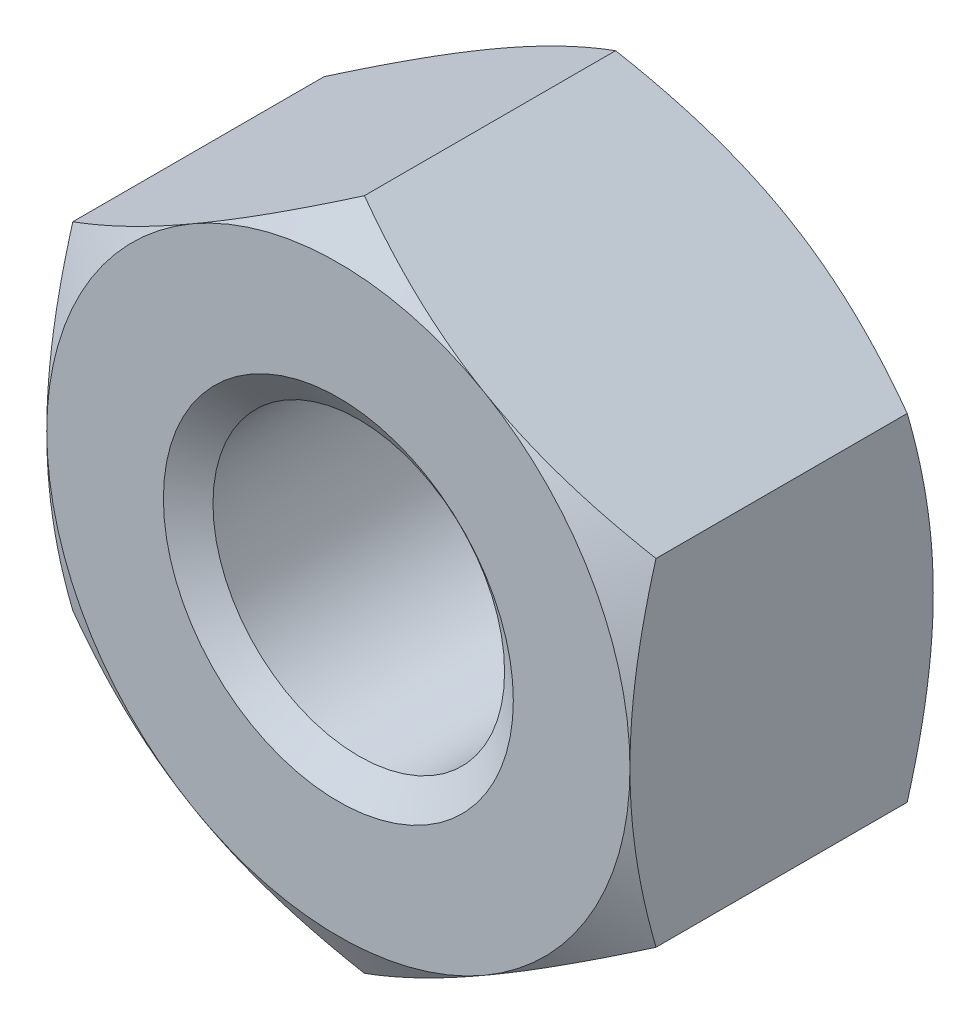
ISO-10303-21;
HEADER;
FILE_DESCRIPTION(('STEP AP214'),'2;1');
FILE_NAME('part.step','',(''),(''),'','','');
FILE_SCHEMA(('AUTOMOTIVE_DESIGN { 1 0 10303 214 1 1 1 1 }'));
ENDSEC;
DATA;
#1=APPLICATION_CONTEXT('core data for automotive mechanical design processes');
#2=APPLICATION_PROTOCOL_DEFINITION('international standard','automotive_design',2000,#1);
#3=PRODUCT_CONTEXT('',#1,'mechanical');
#4=PRODUCT('Part','Part','',(#3));
#5=PRODUCT_RELATED_PRODUCT_CATEGORY('part','',(#4));
#6=PRODUCT_DEFINITION_FORMATION('','',#4);
#7=PRODUCT_DEFINITION_CONTEXT('part definition',#1,'design');
#8=PRODUCT_DEFINITION('design','',#6,#7);
#9=PRODUCT_DEFINITION_SHAPE('','',#8);
#10=(LENGTH_UNIT() NAMED_UNIT(*) SI_UNIT(.MILLI.,.METRE.));
#11=(NAMED_UNIT(*) PLANE_ANGLE_UNIT() SI_UNIT($,.RADIAN.));
#12=(NAMED_UNIT(*) SI_UNIT($,.STERADIAN.) SOLID_ANGLE_UNIT());
#13=UNCERTAINTY_MEASURE_WITH_UNIT(LENGTH_MEASURE(1.E-05),#10,'distance_accuracy_value','');
#14=(GEOMETRIC_REPRESENTATION_CONTEXT(3) GLOBAL_UNCERTAINTY_ASSIGNED_CONTEXT((#13)) GLOBAL_UNIT_ASSIGNED_CONTEXT((#10,
#11,#12)) REPRESENTATION_CONTEXT('',''));
#15=CARTESIAN_POINT('',(0.,0.,0.));
#16=DIRECTION('',(0.,0.,1.));
#17=DIRECTION('',(1.,0.,0.));
#18=AXIS2_PLACEMENT_3D('',#15,#16,#17);
#19=CARTESIAN_POINT('',(0.,0.,-5.2));
#20=DIRECTION('',(0.,0.,1.));
#21=DIRECTION('',(1.,0.,0.));
#22=AXIS2_PLACEMENT_3D('',#19,#20,#21);
#23=CYLINDRICAL_SURFACE('',#22,2.5);
#24=CARTESIAN_POINT('',(0.,0.,-0.350103769104856));
#25=DIRECTION('',(0.,0.,1.));
#26=DIRECTION('',(1.,0.,0.));
#27=AXIS2_PLACEMENT_3D('',#24,#25,#26);
#28=CIRCLE('',#27,2.5);
#29=CARTESIAN_POINT('',(2.5,0.,-0.350103769104856));
#30=VERTEX_POINT('',#29);
#31=EDGE_CURVE('E174',#30,#30,#28,.F.);
#32=ORIENTED_EDGE('',*,*,#31,.F.);
#33=EDGE_LOOP('',(#32));
#34=FACE_BOUND('',#33,.T.);
#35=CARTESIAN_POINT('',(0.,0.,-4.82449623089515));
#36=DIRECTION('',(0.,0.,-1.));
#37=DIRECTION('',(-1.,0.,0.));
#38=AXIS2_PLACEMENT_3D('',#35,#36,#37);
#39=CIRCLE('',#38,2.5);
#40=CARTESIAN_POINT('',(-2.5,0.,-4.82449623089515));
#41=VERTEX_POINT('',#40);
#42=EDGE_CURVE('E39',#41,#41,#39,.F.);
#43=ORIENTED_EDGE('',*,*,#42,.F.);
#44=EDGE_LOOP('',(#43));
#45=FACE_BOUND('',#44,.T.);
#46=ADVANCED_FACE('F34',(#34,#45),#23,.F.);
#47=CARTESIAN_POINT('',(0.,5.77350269189626,-5.2));
#48=DIRECTION('',(-0.500000000000001,0.866025403784438,0.));
#49=DIRECTION('',(-0.866025403784438,-0.500000000000001,0.));
#50=AXIS2_PLACEMENT_3D('',#47,#48,#49);
#51=PLANE('',#50);
#52=DIRECTION('',(0.,0.,1.));
#53=VECTOR('',#52,1.);
#54=CARTESIAN_POINT('',(-5.,2.88675134594813,-5.2));
#55=LINE('',#54,#53);
#56=CARTESIAN_POINT('',(-5.,2.88675134594813,-4.75341801261479));
#57=VERTEX_POINT('',#56);
#58=CARTESIAN_POINT('',(-5.,2.88675134594813,-0.446581987385205));
#59=VERTEX_POINT('',#58);
#60=EDGE_CURVE('E164',#57,#59,#55,.T.);
#61=ORIENTED_EDGE('',*,*,#60,.T.);
#62=CARTESIAN_POINT('',(-5.0002,2.88663587589429,-0.446648656051831));
#63=CARTESIAN_POINT('',(-4.78046540547481,3.01349970319368,-0.373386567637637));
#64=CARTESIAN_POINT('',(-4.55885141554042,3.14144859993849,-0.306751321918093));
#65=CARTESIAN_POINT('',(-4.11178600454649,3.39956193532121,-0.190438991010811));
#66=CARTESIAN_POINT('',(-3.88632664040923,3.52973095989718,-0.140803049915789));
#67=CARTESIAN_POINT('',(-3.43816769477649,3.78847564779798,-0.0635510254186975));
#68=CARTESIAN_POINT('',(-3.2155379068958,3.91701101576052,-0.0354203782834889));
#69=CARTESIAN_POINT('',(-2.88081009815336,4.11026620624323,-0.010194921953684));
#70=CARTESIAN_POINT('',(-2.76915780319494,4.17472868879311,-0.00461345976948343));
#71=CARTESIAN_POINT('',(-2.5457500293262,4.30371322717528,0.000797783248530056));
#72=CARTESIAN_POINT('',(-2.43399455370968,4.36823528110589,0.000627741741796608));
#73=CARTESIAN_POINT('',(-2.12781576914936,4.54500768479195,-0.00775363179203721));
#74=CARTESIAN_POINT('',(-1.93349391403278,4.65719946015293,-0.0218297718972525));
#75=CARTESIAN_POINT('',(-1.54613989800229,4.88083840557981,-0.0664652571094324));
#76=CARTESIAN_POINT('',(-1.35310909862843,4.9922847895602,-0.0970398601475099));
#77=CARTESIAN_POINT('',(-0.964974657525145,5.21637431361295,-0.173468493621166));
#78=CARTESIAN_POINT('',(-0.769920001358263,5.32898917185759,-0.219646378878683));
#79=CARTESIAN_POINT('',(-0.382719654641231,5.55253939626499,-0.324451794491938));
#80=CARTESIAN_POINT('',(-0.190569004591913,5.66347762579592,-0.383054703437379));
#81=CARTESIAN_POINT('',(0.000200000000000074,5.7736181619501,-0.446648656051834));
#82=B_SPLINE_CURVE_WITH_KNOTS('',3,(#62,#63,#64,#65,#66,#67,#68,#69,#70,#71,#72,#73,#74,#75,#76,
#77,#78,#79,#80,#81),.UNSPECIFIED.,.F.,.F.,(4,2,2,2,2,2,2,2,2,4),(0.,0.792555841363091,
1.58701660053334,2.36181537487281,2.74884076077326,3.13585419177295,3.8096236259968,
4.4840172390119,5.17336882348929,5.86136694793726),.UNSPECIFIED.);
#83=CARTESIAN_POINT('',(-2.5,4.33012701892219,0.));
#84=VERTEX_POINT('',#83);
#85=EDGE_CURVE('E133',#59,#84,#82,.T.);
#86=ORIENTED_EDGE('',*,*,#85,.T.);
#87=CARTESIAN_POINT('',(0.,5.77350269189626,-0.446581987385207));
#88=VERTEX_POINT('',#87);
#89=EDGE_CURVE('E53',#84,#88,#82,.T.);
#90=ORIENTED_EDGE('',*,*,#89,.T.);
#91=DIRECTION('',(0.,0.,1.));
#92=VECTOR('',#91,1.);
#93=CARTESIAN_POINT('',(0.,5.77350269189626,-5.2));
#94=LINE('',#93,#92);
#95=CARTESIAN_POINT('',(0.,5.77350269189626,-4.75341801261479));
#96=VERTEX_POINT('',#95);
#97=EDGE_CURVE('E149',#96,#88,#94,.T.);
#98=ORIENTED_EDGE('',*,*,#97,.F.);
#99=CARTESIAN_POINT('',(-5.0002,2.88663587589429,-4.75335134394817));
#100=CARTESIAN_POINT('',(-4.78046540547482,3.01349970319368,-4.82661343236236));
#101=CARTESIAN_POINT('',(-4.55885141554042,3.14144859993849,-4.89324867808191));
#102=CARTESIAN_POINT('',(-4.11178600454649,3.39956193532121,-5.00956100898919));
#103=CARTESIAN_POINT('',(-3.88632664040922,3.52973095989718,-5.05919695008421));
#104=CARTESIAN_POINT('',(-3.43816769477649,3.78847564779798,-5.1364489745813));
#105=CARTESIAN_POINT('',(-3.2155379068958,3.91701101576052,-5.16457962171651));
#106=CARTESIAN_POINT('',(-2.88081009815336,4.11026620624323,-5.18980507804632));
#107=CARTESIAN_POINT('',(-2.76915780319494,4.17472868879311,-5.19538654023052));
#108=CARTESIAN_POINT('',(-2.5457500293262,4.30371322717528,-5.20079778324853));
#109=CARTESIAN_POINT('',(-2.43399455370968,4.36823528110589,-5.2006277417418));
#110=CARTESIAN_POINT('',(-2.12781576914936,4.54500768479195,-5.19224636820796));
#111=CARTESIAN_POINT('',(-1.93349391403278,4.65719946015293,-5.17817022810275));
#112=CARTESIAN_POINT('',(-1.54613989800229,4.88083840557981,-5.13353474289057));
#113=CARTESIAN_POINT('',(-1.35310909862843,4.9922847895602,-5.10296013985249));
#114=CARTESIAN_POINT('',(-0.964974657525144,5.21637431361295,-5.02653150637883));
#115=CARTESIAN_POINT('',(-0.769920001358264,5.32898917185759,-4.98035362112132));
#116=CARTESIAN_POINT('',(-0.382719654641232,5.55253939626499,-4.87554820550806));
#117=CARTESIAN_POINT('',(-0.190569004591913,5.66347762579592,-4.81694529656262));
#118=CARTESIAN_POINT('',(0.000200000000000076,5.7736181619501,-4.75335134394817));
#119=B_SPLINE_CURVE_WITH_KNOTS('',3,(#99,#100,#101,#102,#103,#104,#105,#106,#107,#108,#109,#110,
#111,#112,#113,#114,#115,#116,#117,#118),.UNSPECIFIED.,.F.,.F.,(4,2,2,2,2,2,2,2,2,4),(0.,
0.792555841363092,1.58701660053334,2.36181537487281,2.74884076077326,3.13585419177295,
3.8096236259968,4.4840172390119,5.17336882348929,5.86136694793726),.UNSPECIFIED.);
#120=CARTESIAN_POINT('',(-2.5,4.33012701892219,-5.2));
#121=VERTEX_POINT('',#120);
#122=EDGE_CURVE('E167',#121,#96,#119,.T.);
#123=ORIENTED_EDGE('',*,*,#122,.F.);
#124=EDGE_CURVE('E266',#57,#121,#119,.T.);
#125=ORIENTED_EDGE('',*,*,#124,.F.);
#126=EDGE_LOOP('',(#61,#86,#90,#98,#123,#125));
#127=FACE_BOUND('',#126,.T.);
#128=ADVANCED_FACE('F36',(#127),#51,.T.);
#129=CARTESIAN_POINT('',(5.,2.88675134594813,-5.2));
#130=DIRECTION('',(0.5,0.866025403784438,0.));
#131=DIRECTION('',(-0.866025403784438,0.5,0.));
#132=AXIS2_PLACEMENT_3D('',#129,#130,#131);
#133=PLANE('',#132);
#134=ORIENTED_EDGE('',*,*,#97,.T.);
#135=CARTESIAN_POINT('',(-0.000200000000000693,5.7736181619501,-0.446648656051833));
#136=CARTESIAN_POINT('',(0.219534594525184,5.64675433465071,-0.373386567637639));
#137=CARTESIAN_POINT('',(0.44114858445958,5.5188054379059,-0.306751321918095));
#138=CARTESIAN_POINT('',(0.888213995453514,5.26069210252318,-0.190438991010812));
#139=CARTESIAN_POINT('',(1.11367335959077,5.13052307794721,-0.14080304991579));
#140=CARTESIAN_POINT('',(1.56183230522351,4.87177839004641,-0.0635510254186981));
#141=CARTESIAN_POINT('',(1.78446209310419,4.74324302208387,-0.0354203782834897));
#142=CARTESIAN_POINT('',(2.11918990184664,4.54998783160116,-0.0101949219536844));
#143=CARTESIAN_POINT('',(2.23084219680506,4.48552534905128,-0.00461345976948354));
#144=CARTESIAN_POINT('',(2.4542499706738,4.35654081066911,0.000797783248530181));
#145=CARTESIAN_POINT('',(2.56600544629032,4.2920187567385,0.000627741741796696));
#146=CARTESIAN_POINT('',(2.87218423085064,4.11524635305244,-0.007753631792037));
#147=CARTESIAN_POINT('',(3.06650608596722,4.00305457769146,-0.0218297718972519));
#148=CARTESIAN_POINT('',(3.45386010199771,3.77941563226457,-0.0664652571094314));
#149=CARTESIAN_POINT('',(3.64689090137157,3.66796924828418,-0.0970398601475088));
#150=CARTESIAN_POINT('',(4.03502534247486,3.44387972423144,-0.173468493621165));
#151=CARTESIAN_POINT('',(4.23007999864174,3.3312648659868,-0.219646378878682));
#152=CARTESIAN_POINT('',(4.61728034535877,3.1077146415794,-0.324451794491937));
#153=CARTESIAN_POINT('',(4.80943099540809,2.99677641204847,-0.383054703437377));
#154=CARTESIAN_POINT('',(5.0002,2.88663587589429,-0.446648656051832));
#155=B_SPLINE_CURVE_WITH_KNOTS('',3,(#135,#136,#137,#138,#139,#140,#141,#142,#143,#144,#145,
#146,#147,#148,#149,#150,#151,#152,#153,#154),.UNSPECIFIED.,.F.,.F.,(4,2,2,2,2,2,2,2,2,4),(0.,
0.792555841363093,1.58701660053334,2.36181537487281,2.74884076077326,3.13585419177295,
3.8096236259968,4.4840172390119,5.17336882348929,5.86136694793726),.UNSPECIFIED.);
#156=CARTESIAN_POINT('',(2.5,4.33012701892219,0.));
#157=VERTEX_POINT('',#156);
#158=EDGE_CURVE('E143',#88,#157,#155,.T.);
#159=ORIENTED_EDGE('',*,*,#158,.T.);
#160=CARTESIAN_POINT('',(5.,2.88675134594813,-0.446581987385207));
#161=VERTEX_POINT('',#160);
#162=EDGE_CURVE('E60',#157,#161,#155,.T.);
#163=ORIENTED_EDGE('',*,*,#162,.T.);
#164=DIRECTION('',(0.,0.,1.));
#165=VECTOR('',#164,1.);
#166=CARTESIAN_POINT('',(5.,2.88675134594813,-5.2));
#167=LINE('',#166,#165);
#168=CARTESIAN_POINT('',(5.,2.88675134594813,-4.75341801261479));
#169=VERTEX_POINT('',#168);
#170=EDGE_CURVE('E142',#169,#161,#167,.T.);
#171=ORIENTED_EDGE('',*,*,#170,.F.);
#172=CARTESIAN_POINT('',(-0.000200000000000693,5.7736181619501,-4.75335134394817));
#173=CARTESIAN_POINT('',(0.219534594525184,5.64675433465071,-4.82661343236236));
#174=CARTESIAN_POINT('',(0.44114858445958,5.5188054379059,-4.89324867808191));
#175=CARTESIAN_POINT('',(0.888213995453514,5.26069210252318,-5.00956100898919));
#176=CARTESIAN_POINT('',(1.11367335959078,5.13052307794721,-5.05919695008421));
#177=CARTESIAN_POINT('',(1.56183230522351,4.87177839004641,-5.1364489745813));
#178=CARTESIAN_POINT('',(1.7844620931042,4.74324302208387,-5.16457962171651));
#179=CARTESIAN_POINT('',(2.11918990184665,4.54998783160116,-5.18980507804632));
#180=CARTESIAN_POINT('',(2.23084219680506,4.48552534905128,-5.19538654023052));
#181=CARTESIAN_POINT('',(2.4542499706738,4.35654081066911,-5.20079778324853));
#182=CARTESIAN_POINT('',(2.56600544629032,4.2920187567385,-5.2006277417418));
#183=CARTESIAN_POINT('',(2.87218423085064,4.11524635305244,-5.19224636820796));
#184=CARTESIAN_POINT('',(3.06650608596722,4.00305457769146,-5.17817022810275));
#185=CARTESIAN_POINT('',(3.45386010199771,3.77941563226457,-5.13353474289057));
#186=CARTESIAN_POINT('',(3.64689090137157,3.66796924828418,-5.10296013985249));
#187=CARTESIAN_POINT('',(4.03502534247485,3.44387972423144,-5.02653150637883));
#188=CARTESIAN_POINT('',(4.23007999864174,3.3312648659868,-4.98035362112132));
#189=CARTESIAN_POINT('',(4.61728034535877,3.1077146415794,-4.87554820550806));
#190=CARTESIAN_POINT('',(4.80943099540809,2.99677641204847,-4.81694529656262));
#191=CARTESIAN_POINT('',(5.0002,2.88663587589429,-4.75335134394817));
#192=B_SPLINE_CURVE_WITH_KNOTS('',3,(#172,#173,#174,#175,#176,#177,#178,#179,#180,#181,#182,
#183,#184,#185,#186,#187,#188,#189,#190,#191),.UNSPECIFIED.,.F.,.F.,(4,2,2,2,2,2,2,2,2,4),(0.,
0.792555841363093,1.58701660053334,2.36181537487281,2.74884076077326,3.13585419177296,
3.8096236259968,4.4840172390119,5.17336882348929,5.86136694793725),.UNSPECIFIED.);
#193=CARTESIAN_POINT('',(2.5,4.33012701892219,-5.2));
#194=VERTEX_POINT('',#193);
#195=EDGE_CURVE('E259',#194,#169,#192,.T.);
#196=ORIENTED_EDGE('',*,*,#195,.F.);
#197=EDGE_CURVE('E265',#96,#194,#192,.T.);
#198=ORIENTED_EDGE('',*,*,#197,.F.);
#199=EDGE_LOOP('',(#134,#159,#163,#171,#196,#198));
#200=FACE_BOUND('',#199,.T.);
#201=ADVANCED_FACE('F140',(#200),#133,.T.);
#202=CARTESIAN_POINT('',(5.,2.88675134594813,-5.2));
#203=DIRECTION('',(-1.,0.,0.));
#204=DIRECTION('',(0.,0.,1.));
#205=AXIS2_PLACEMENT_3D('',#202,#203,#204);
#206=PLANE('',#205);
#207=CARTESIAN_POINT('',(5.,-7.65608998744865,-2.3926335265508));
#208=CARTESIAN_POINT('',(5.,-7.43656171400166,-2.28654533817208));
#209=CARTESIAN_POINT('',(5.,-7.21651440170022,-2.18151175461596));
#210=CARTESIAN_POINT('',(5.,-6.77510105921518,-1.97415643363977));
#211=CARTESIAN_POINT('',(5.,-6.55373480873053,-1.87183516574569));
#212=CARTESIAN_POINT('',(5.,-6.10820714710357,-1.66996807853491));
#213=CARTESIAN_POINT('',(5.,-5.88403698971124,-1.57044149281731));
#214=CARTESIAN_POINT('',(5.,-5.43385418074677,-1.37566323278682));
#215=CARTESIAN_POINT('',(5.,-5.20784162594278,-1.28041133564243));
#216=CARTESIAN_POINT('',(5.,-4.75080884782756,-1.09418830918942));
#217=CARTESIAN_POINT('',(5.,-4.51976121099505,-1.0032840909987));
#218=CARTESIAN_POINT('',(5.,-4.054940534221,-0.828595302971951));
#219=CARTESIAN_POINT('',(5.,-3.82116719434025,-0.744811525247654));
#220=CARTESIAN_POINT('',(5.,-3.35100416711889,-0.58661463236462));
#221=CARTESIAN_POINT('',(5.,-3.11462125088188,-0.512181595225272));
#222=CARTESIAN_POINT('',(5.,-2.63849247870023,-0.375104393872378));
#223=CARTESIAN_POINT('',(5.,-2.3987477121033,-0.31245650159695));
#224=CARTESIAN_POINT('',(5.,-1.91574303714497,-0.201987753994869));
#225=CARTESIAN_POINT('',(5.,-1.672482210841,-0.154170846558642));
#226=CARTESIAN_POINT('',(5.,-1.18299359688664,-0.0765955557924023));
#227=CARTESIAN_POINT('',(5.,-0.93676580661328,-0.0468371884284091));
#228=CARTESIAN_POINT('',(5.,-0.567032279323846,-0.0176512015862963));
#229=CARTESIAN_POINT('',(5.,-0.444105297658538,-0.0104963190599468));
#230=CARTESIAN_POINT('',(5.,-0.198053005238563,-0.00139545226904065));
#231=CARTESIAN_POINT('',(5.,-0.0749276970802267,0.00055059963961463));
#232=CARTESIAN_POINT('',(5.,0.171257999892355,-0.000818470345664016));
#233=CARTESIAN_POINT('',(5.,0.29431839722709,-0.00413211431301166));
#234=CARTESIAN_POINT('',(5.,0.540192730788843,-0.0159365972827601));
#235=CARTESIAN_POINT('',(5.,0.663006654263486,-0.0244276975701651));
#236=CARTESIAN_POINT('',(5.,0.960681872881669,-0.051106380275301));
#237=CARTESIAN_POINT('',(5.,1.1353143627994,-0.0718889676982865));
#238=CARTESIAN_POINT('',(5.,1.48321675799389,-0.122765655722696));
#239=CARTESIAN_POINT('',(5.,1.65648647841236,-0.152860997990035));
#240=CARTESIAN_POINT('',(5.,2.00155426058699,-0.221298792011552));
#241=CARTESIAN_POINT('',(5.,2.17335067370373,-0.259649477486406));
#242=CARTESIAN_POINT('',(5.,2.51518168221054,-0.343428305385012));
#243=CARTESIAN_POINT('',(5.,2.68521638419311,-0.388856016914003));
#244=CARTESIAN_POINT('',(5.,3.02770318928892,-0.486887782054293));
#245=CARTESIAN_POINT('',(5.,3.20011248435312,-0.539640363823943));
#246=CARTESIAN_POINT('',(5.,3.54310870430177,-0.650357787302627));
#247=CARTESIAN_POINT('',(5.,3.71369679659714,-0.708319033907071));
#248=CARTESIAN_POINT('',(5.,4.05236610267974,-0.828256540728475));
#249=CARTESIAN_POINT('',(5.,4.22045602230056,-0.890208365426366));
#250=CARTESIAN_POINT('',(5.,4.55533171687448,-1.01774823413812));
#251=CARTESIAN_POINT('',(5.,4.72211693321414,-1.08333774778777));
#252=CARTESIAN_POINT('',(5.,4.88829623733355,-1.15038625817724));
#253=B_SPLINE_CURVE_WITH_KNOTS('',3,(#207,#208,#209,#210,#211,#212,#213,#214,#215,#216,#217,
#218,#219,#220,#221,#222,#223,#224,#225,#226,#227,#228,#229,#230,#231,#232,#233,#234,#235,#236,
#237,#238,#239,#240,#241,#242,#243,#244,#245,#246,#247,#248,#249,#250,#251,#252),.UNSPECIFIED.,
.F.,.F.,(4,2,2,2,2,2,2,2,2,2,2,2,2,2,2,2,2,2,2,2,2,2,4),(0.,0.731464740665352,1.46305528824909,
2.19883243307486,2.93457117856034,3.67934251246858,4.42419659013361,5.1674358087199,
5.91043951739339,6.65364083834806,7.39684281638516,7.76615414335457,8.13546067426611,
8.50466345177856,8.87388486298453,9.40118542949727,9.92855633110015,10.4564556797854,
10.9843228991235,11.525120280828,12.065547221064,12.6029322754131,13.1405360390026),.UNSPECIFIED.);
#254=CARTESIAN_POINT('',(5.,-2.88675134594813,-0.446581987385207));
#255=VERTEX_POINT('',#254);
#256=CARTESIAN_POINT('',(5.,0.,0.));
#257=VERTEX_POINT('',#256);
#258=EDGE_CURVE('E135',#255,#257,#253,.T.);
#259=ORIENTED_EDGE('',*,*,#258,.F.);
#260=DIRECTION('',(0.,0.,1.));
#261=VECTOR('',#260,1.);
#262=CARTESIAN_POINT('',(5.,-2.88675134594813,-5.2));
#263=LINE('',#262,#261);
#264=CARTESIAN_POINT('',(5.,-2.88675134594813,-4.75341801261479));
#265=VERTEX_POINT('',#264);
#266=EDGE_CURVE('E150',#265,#255,#263,.T.);
#267=ORIENTED_EDGE('',*,*,#266,.F.);
#268=CARTESIAN_POINT('',(5.,-7.65608998744865,-2.8073664734492));
#269=CARTESIAN_POINT('',(5.,-7.43656171400166,-2.91345466182793));
#270=CARTESIAN_POINT('',(5.,-7.21651440170021,-3.01848824538404));
#271=CARTESIAN_POINT('',(5.,-6.77510105921518,-3.22584356636024));
#272=CARTESIAN_POINT('',(5.,-6.55373480873052,-3.32816483425431));
#273=CARTESIAN_POINT('',(5.,-6.10820714710357,-3.53003192146509));
#274=CARTESIAN_POINT('',(5.,-5.88403698971124,-3.62955850718269));
#275=CARTESIAN_POINT('',(5.,-5.43385418074677,-3.82433676721318));
#276=CARTESIAN_POINT('',(5.,-5.20784162594278,-3.91958866435757));
#277=CARTESIAN_POINT('',(5.,-4.75080884782756,-4.10581169081059));
#278=CARTESIAN_POINT('',(5.,-4.51976121099505,-4.1967159090013));
#279=CARTESIAN_POINT('',(5.,-4.05494053422099,-4.37140469702805));
#280=CARTESIAN_POINT('',(5.,-3.82116719434025,-4.45518847475235));
#281=CARTESIAN_POINT('',(5.,-3.35100416711889,-4.61338536763538));
#282=CARTESIAN_POINT('',(5.,-3.11462125088188,-4.68781840477473));
#283=CARTESIAN_POINT('',(5.,-2.63849247870023,-4.82489560612762));
#284=CARTESIAN_POINT('',(5.,-2.3987477121033,-4.88754349840305));
#285=CARTESIAN_POINT('',(5.,-1.91574303714497,-4.99801224600513));
#286=CARTESIAN_POINT('',(5.,-1.672482210841,-5.04582915344136));
#287=CARTESIAN_POINT('',(5.,-1.18299359688664,-5.1234044442076));
#288=CARTESIAN_POINT('',(5.,-0.936765806613281,-5.15316281157159));
#289=CARTESIAN_POINT('',(5.,-0.567032279323847,-5.1823487984137));
#290=CARTESIAN_POINT('',(5.,-0.444105297658539,-5.18950368094005));
#291=CARTESIAN_POINT('',(5.,-0.198053005238563,-5.19860454773096));
#292=CARTESIAN_POINT('',(5.,-0.0749276970802268,-5.20055059963962));
#293=CARTESIAN_POINT('',(5.,0.171257999892356,-5.19918152965434));
#294=CARTESIAN_POINT('',(5.,0.294318397227091,-5.19586788568699));
#295=CARTESIAN_POINT('',(5.,0.540192730788843,-5.18406340271724));
#296=CARTESIAN_POINT('',(5.,0.663006654263486,-5.17557230242983));
#297=CARTESIAN_POINT('',(5.,0.960681872881668,-5.1488936197247));
#298=CARTESIAN_POINT('',(5.,1.1353143627994,-5.12811103230171));
#299=CARTESIAN_POINT('',(5.,1.48321675799389,-5.0772343442773));
#300=CARTESIAN_POINT('',(5.,1.65648647841236,-5.04713900200997));
#301=CARTESIAN_POINT('',(5.,2.00155426058699,-4.97870120798845));
#302=CARTESIAN_POINT('',(5.,2.17335067370373,-4.94035052251359));
#303=CARTESIAN_POINT('',(5.,2.51518168221054,-4.85657169461499));
#304=CARTESIAN_POINT('',(5.,2.68521638419311,-4.811143983086));
#305=CARTESIAN_POINT('',(5.,3.02770318928892,-4.71311221794571));
#306=CARTESIAN_POINT('',(5.,3.20011248435312,-4.66035963617606));
#307=CARTESIAN_POINT('',(5.,3.54310870430177,-4.54964221269737));
#308=CARTESIAN_POINT('',(5.,3.71369679659715,-4.49168096609293));
#309=CARTESIAN_POINT('',(5.,4.05236610267974,-4.37174345927152));
#310=CARTESIAN_POINT('',(5.,4.22045602230056,-4.30979163457363));
#311=CARTESIAN_POINT('',(5.,4.55533171687448,-4.18225176586188));
#312=CARTESIAN_POINT('',(5.,4.72211693321414,-4.11666225221223));
#313=CARTESIAN_POINT('',(5.,4.88829623733355,-4.04961374182276));
#314=B_SPLINE_CURVE_WITH_KNOTS('',3,(#268,#269,#270,#271,#272,#273,#274,#275,#276,#277,#278,
#279,#280,#281,#282,#283,#284,#285,#286,#287,#288,#289,#290,#291,#292,#293,#294,#295,#296,#297,
#298,#299,#300,#301,#302,#303,#304,#305,#306,#307,#308,#309,#310,#311,#312,#313),.UNSPECIFIED.,
.F.,.F.,(4,2,2,2,2,2,2,2,2,2,2,2,2,2,2,2,2,2,2,2,2,2,4),(0.,0.731464740665352,1.46305528824909,
2.19883243307486,2.93457117856034,3.67934251246858,4.42419659013361,5.16743580871989,
5.91043951739339,6.65364083834806,7.39684281638516,7.76615414335456,8.13546067426611,
8.50466345177856,8.87388486298453,9.40118542949727,9.92855633110015,10.4564556797854,
10.9843228991235,11.525120280828,12.065547221064,12.6029322754131,13.1405360390026),.UNSPECIFIED.);
#315=CARTESIAN_POINT('',(5.,0.,-5.2));
#316=VERTEX_POINT('',#315);
#317=EDGE_CURVE('E273',#265,#316,#314,.T.);
#318=ORIENTED_EDGE('',*,*,#317,.T.);
#319=EDGE_CURVE('E148',#316,#169,#314,.T.);
#320=ORIENTED_EDGE('',*,*,#319,.T.);
#321=ORIENTED_EDGE('',*,*,#170,.T.);
#322=EDGE_CURVE('E125',#257,#161,#253,.T.);
#323=ORIENTED_EDGE('',*,*,#322,.F.);
#324=EDGE_LOOP('',(#259,#267,#318,#320,#321,#323));
#325=FACE_BOUND('',#324,.T.);
#326=ADVANCED_FACE('F146',(#325),#206,.F.);
#327=CARTESIAN_POINT('',(0.,-5.77350269189627,-5.2));
#328=DIRECTION('',(0.500000000000001,-0.866025403784438,0.));
#329=DIRECTION('',(0.866025403784438,0.500000000000001,0.));
#330=AXIS2_PLACEMENT_3D('',#327,#328,#329);
#331=PLANE('',#330);
#332=ORIENTED_EDGE('',*,*,#266,.T.);
#333=CARTESIAN_POINT('',(5.0002,-2.88663587589429,-0.446648656051833));
#334=CARTESIAN_POINT('',(4.78046540547481,-3.01349970319368,-0.373386567637638));
#335=CARTESIAN_POINT('',(4.55885141554042,-3.14144859993849,-0.306751321918095));
#336=CARTESIAN_POINT('',(4.11178600454648,-3.39956193532121,-0.190438991010813));
#337=CARTESIAN_POINT('',(3.88632664040922,-3.52973095989718,-0.140803049915791));
#338=CARTESIAN_POINT('',(3.43816769477649,-3.78847564779798,-0.0635510254186995));
#339=CARTESIAN_POINT('',(3.2155379068958,-3.91701101576052,-0.035420378283491));
#340=CARTESIAN_POINT('',(2.88081009815336,-4.11026620624323,-0.0101949219536864));
#341=CARTESIAN_POINT('',(2.76915780319494,-4.17472868879311,-0.004613459769486));
#342=CARTESIAN_POINT('',(2.5457500293262,-4.30371322717528,0.000797783248527389));
#343=CARTESIAN_POINT('',(2.43399455370968,-4.36823528110589,0.00062774174179399));
#344=CARTESIAN_POINT('',(2.12781576914936,-4.54500768479195,-0.00775363179203984));
#345=CARTESIAN_POINT('',(1.93349391403278,-4.65719946015293,-0.0218297718972553));
#346=CARTESIAN_POINT('',(1.54613989800229,-4.88083840557982,-0.0664652571094354));
#347=CARTESIAN_POINT('',(1.35310909862843,-4.99228478956021,-0.097039860147513));
#348=CARTESIAN_POINT('',(0.964974657525145,-5.21637431361296,-0.173468493621169));
#349=CARTESIAN_POINT('',(0.769920001358263,-5.32898917185759,-0.219646378878686));
#350=CARTESIAN_POINT('',(0.382719654641232,-5.55253939626499,-0.324451794491941));
#351=CARTESIAN_POINT('',(0.190569004591914,-5.66347762579593,-0.383054703437381));
#352=CARTESIAN_POINT('',(-0.000199999999999168,-5.7736181619501,-0.446648656051837));
#353=B_SPLINE_CURVE_WITH_KNOTS('',3,(#333,#334,#335,#336,#337,#338,#339,#340,#341,#342,#343,
#344,#345,#346,#347,#348,#349,#350,#351,#352),.UNSPECIFIED.,.F.,.F.,(4,2,2,2,2,2,2,2,2,4),(0.,
0.792555841363093,1.58701660053334,2.36181537487281,2.74884076077326,3.13585419177295,
3.8096236259968,4.4840172390119,5.17336882348929,5.86136694793725),.UNSPECIFIED.);
#354=CARTESIAN_POINT('',(2.5,-4.33012701892219,0.));
#355=VERTEX_POINT('',#354);
#356=EDGE_CURVE('E371',#255,#355,#353,.T.);
#357=ORIENTED_EDGE('',*,*,#356,.T.);
#358=CARTESIAN_POINT('',(0.,-5.77350269189626,-0.446581987385207));
#359=VERTEX_POINT('',#358);
#360=EDGE_CURVE('E227',#355,#359,#353,.T.);
#361=ORIENTED_EDGE('',*,*,#360,.T.);
#362=DIRECTION('',(0.,0.,1.));
#363=VECTOR('',#362,1.);
#364=CARTESIAN_POINT('',(0.,-5.77350269189627,-5.2));
#365=LINE('',#364,#363);
#366=CARTESIAN_POINT('',(0.,-5.77350269189626,-4.75341801261479));
#367=VERTEX_POINT('',#366);
#368=EDGE_CURVE('E155',#367,#359,#365,.T.);
#369=ORIENTED_EDGE('',*,*,#368,.F.);
#370=CARTESIAN_POINT('',(5.0002,-2.88663587589429,-4.75335134394817));
#371=CARTESIAN_POINT('',(4.78046540547481,-3.01349970319368,-4.82661343236236));
#372=CARTESIAN_POINT('',(4.55885141554042,-3.14144859993849,-4.89324867808191));
#373=CARTESIAN_POINT('',(4.11178600454649,-3.39956193532121,-5.00956100898919));
#374=CARTESIAN_POINT('',(3.88632664040922,-3.52973095989718,-5.05919695008421));
#375=CARTESIAN_POINT('',(3.43816769477649,-3.78847564779798,-5.1364489745813));
#376=CARTESIAN_POINT('',(3.2155379068958,-3.91701101576052,-5.16457962171651));
#377=CARTESIAN_POINT('',(2.88081009815336,-4.11026620624323,-5.18980507804631));
#378=CARTESIAN_POINT('',(2.76915780319494,-4.17472868879311,-5.19538654023051));
#379=CARTESIAN_POINT('',(2.5457500293262,-4.30371322717528,-5.20079778324853));
#380=CARTESIAN_POINT('',(2.43399455370968,-4.3682352811059,-5.20062774174179));
#381=CARTESIAN_POINT('',(2.12781576914936,-4.54500768479195,-5.19224636820796));
#382=CARTESIAN_POINT('',(1.93349391403278,-4.65719946015293,-5.17817022810274));
#383=CARTESIAN_POINT('',(1.54613989800229,-4.88083840557982,-5.13353474289056));
#384=CARTESIAN_POINT('',(1.35310909862843,-4.99228478956021,-5.10296013985249));
#385=CARTESIAN_POINT('',(0.964974657525144,-5.21637431361296,-5.02653150637883));
#386=CARTESIAN_POINT('',(0.769920001358262,-5.32898917185759,-4.98035362112131));
#387=CARTESIAN_POINT('',(0.382719654641231,-5.55253939626499,-4.87554820550806));
#388=CARTESIAN_POINT('',(0.190569004591913,-5.66347762579592,-4.81694529656262));
#389=CARTESIAN_POINT('',(-0.000199999999999404,-5.7736181619501,-4.75335134394816));
#390=B_SPLINE_CURVE_WITH_KNOTS('',3,(#370,#371,#372,#373,#374,#375,#376,#377,#378,#379,#380,
#381,#382,#383,#384,#385,#386,#387,#388,#389),.UNSPECIFIED.,.F.,.F.,(4,2,2,2,2,2,2,2,2,4),(0.,
0.792555841363092,1.58701660053334,2.36181537487281,2.74884076077326,3.13585419177295,
3.8096236259968,4.4840172390119,5.17336882348929,5.86136694793726),.UNSPECIFIED.);
#391=CARTESIAN_POINT('',(2.5,-4.33012701892219,-5.2));
#392=VERTEX_POINT('',#391);
#393=EDGE_CURVE('E280',#392,#367,#390,.T.);
#394=ORIENTED_EDGE('',*,*,#393,.F.);
#395=EDGE_CURVE('E279',#265,#392,#390,.T.);
#396=ORIENTED_EDGE('',*,*,#395,.F.);
#397=EDGE_LOOP('',(#332,#357,#361,#369,#394,#396));
#398=FACE_BOUND('',#397,.T.);
#399=ADVANCED_FACE('F292',(#398),#331,.T.);
#400=CARTESIAN_POINT('',(-5.,-2.88675134594813,-5.2));
#401=DIRECTION('',(-0.5,-0.866025403784438,0.));
#402=DIRECTION('',(0.866025403784438,-0.5,0.));
#403=AXIS2_PLACEMENT_3D('',#400,#401,#402);
#404=PLANE('',#403);
#405=ORIENTED_EDGE('',*,*,#368,.T.);
#406=CARTESIAN_POINT('',(0.000200000000000162,-5.7736181619501,-0.446648656051837));
#407=CARTESIAN_POINT('',(-0.219534594525185,-5.64675433465071,-0.373386567637641));
#408=CARTESIAN_POINT('',(-0.441148584459581,-5.5188054379059,-0.306751321918098));
#409=CARTESIAN_POINT('',(-0.888213995453515,-5.26069210252319,-0.190438991010815));
#410=CARTESIAN_POINT('',(-1.11367335959078,-5.13052307794722,-0.140803049915793));
#411=CARTESIAN_POINT('',(-1.56183230522351,-4.87177839004641,-0.0635510254187012));
#412=CARTESIAN_POINT('',(-1.7844620931042,-4.74324302208387,-0.0354203782834919));
#413=CARTESIAN_POINT('',(-2.11918990184665,-4.54998783160117,-0.010194921953687));
#414=CARTESIAN_POINT('',(-2.23084219680507,-4.48552534905128,-0.00461345976948661));
#415=CARTESIAN_POINT('',(-2.4542499706738,-4.35654081066911,0.000797783248526979));
#416=CARTESIAN_POINT('',(-2.56600544629032,-4.2920187567385,0.000627741741793834));
#417=CARTESIAN_POINT('',(-2.87218423085064,-4.11524635305245,-0.00775363179203957));
#418=CARTESIAN_POINT('',(-3.06650608596722,-4.00305457769146,-0.021829771897255));
#419=CARTESIAN_POINT('',(-3.45386010199771,-3.77941563226458,-0.0664652571094347));
#420=CARTESIAN_POINT('',(-3.64689090137157,-3.66796924828419,-0.097039860147512));
#421=CARTESIAN_POINT('',(-4.03502534247486,-3.44387972423144,-0.173468493621168));
#422=CARTESIAN_POINT('',(-4.23007999864174,-3.3312648659868,-0.219646378878684));
#423=CARTESIAN_POINT('',(-4.61728034535877,-3.10771464157941,-0.324451794491938));
#424=CARTESIAN_POINT('',(-4.80943099540809,-2.99677641204847,-0.383054703437379));
#425=CARTESIAN_POINT('',(-5.0002,-2.8866358758943,-0.446648656051833));
#426=B_SPLINE_CURVE_WITH_KNOTS('',3,(#406,#407,#408,#409,#410,#411,#412,#413,#414,#415,#416,
#417,#418,#419,#420,#421,#422,#423,#424,#425),.UNSPECIFIED.,.F.,.F.,(4,2,2,2,2,2,2,2,2,4),(0.,
0.792555841363092,1.58701660053334,2.36181537487281,2.74884076077326,3.13585419177296,
3.8096236259968,4.4840172390119,5.17336882348929,5.86136694793725),.UNSPECIFIED.);
#427=CARTESIAN_POINT('',(-2.5,-4.33012701892219,0.));
#428=VERTEX_POINT('',#427);
#429=EDGE_CURVE('E368',#359,#428,#426,.T.);
#430=ORIENTED_EDGE('',*,*,#429,.T.);
#431=CARTESIAN_POINT('',(-5.,-2.88675134594813,-0.446581987385207));
#432=VERTEX_POINT('',#431);
#433=EDGE_CURVE('E200',#428,#432,#426,.T.);
#434=ORIENTED_EDGE('',*,*,#433,.T.);
#435=DIRECTION('',(0.,0.,1.));
#436=VECTOR('',#435,1.);
#437=CARTESIAN_POINT('',(-5.,-2.88675134594813,-5.2));
#438=LINE('',#437,#436);
#439=CARTESIAN_POINT('',(-5.,-2.88675134594813,-4.75341801261479));
#440=VERTEX_POINT('',#439);
#441=EDGE_CURVE('E161',#440,#432,#438,.T.);
#442=ORIENTED_EDGE('',*,*,#441,.F.);
#443=CARTESIAN_POINT('',(0.000200000000000118,-5.7736181619501,-4.75335134394816));
#444=CARTESIAN_POINT('',(-0.219534594525185,-5.64675433465071,-4.82661343236236));
#445=CARTESIAN_POINT('',(-0.441148584459581,-5.5188054379059,-4.8932486780819));
#446=CARTESIAN_POINT('',(-0.888213995453515,-5.26069210252318,-5.00956100898918));
#447=CARTESIAN_POINT('',(-1.11367335959078,-5.13052307794722,-5.05919695008421));
#448=CARTESIAN_POINT('',(-1.56183230522351,-4.87177839004642,-5.1364489745813));
#449=CARTESIAN_POINT('',(-1.7844620931042,-4.74324302208387,-5.16457962171651));
#450=CARTESIAN_POINT('',(-2.11918990184665,-4.54998783160117,-5.18980507804631));
#451=CARTESIAN_POINT('',(-2.23084219680507,-4.48552534905128,-5.19538654023051));
#452=CARTESIAN_POINT('',(-2.4542499706738,-4.35654081066911,-5.20079778324853));
#453=CARTESIAN_POINT('',(-2.56600544629032,-4.2920187567385,-5.20062774174179));
#454=CARTESIAN_POINT('',(-2.87218423085064,-4.11524635305245,-5.19224636820796));
#455=CARTESIAN_POINT('',(-3.06650608596722,-4.00305457769146,-5.17817022810274));
#456=CARTESIAN_POINT('',(-3.45386010199771,-3.77941563226458,-5.13353474289057));
#457=CARTESIAN_POINT('',(-3.64689090137157,-3.66796924828419,-5.10296013985249));
#458=CARTESIAN_POINT('',(-4.03502534247486,-3.44387972423144,-5.02653150637883));
#459=CARTESIAN_POINT('',(-4.23007999864174,-3.3312648659868,-4.98035362112132));
#460=CARTESIAN_POINT('',(-4.61728034535877,-3.10771464157941,-4.87554820550806));
#461=CARTESIAN_POINT('',(-4.80943099540809,-2.99677641204847,-4.81694529656262));
#462=CARTESIAN_POINT('',(-5.0002,-2.8866358758943,-4.75335134394817));
#463=B_SPLINE_CURVE_WITH_KNOTS('',3,(#443,#444,#445,#446,#447,#448,#449,#450,#451,#452,#453,
#454,#455,#456,#457,#458,#459,#460,#461,#462),.UNSPECIFIED.,.F.,.F.,(4,2,2,2,2,2,2,2,2,4),(0.,
0.792555841363093,1.58701660053334,2.36181537487281,2.74884076077326,3.13585419177296,
3.8096236259968,4.4840172390119,5.17336882348929,5.86136694793726),.UNSPECIFIED.);
#464=CARTESIAN_POINT('',(-2.5,-4.33012701892219,-5.2));
#465=VERTEX_POINT('',#464);
#466=EDGE_CURVE('E287',#465,#440,#463,.T.);
#467=ORIENTED_EDGE('',*,*,#466,.F.);
#468=EDGE_CURVE('E286',#367,#465,#463,.T.);
#469=ORIENTED_EDGE('',*,*,#468,.F.);
#470=EDGE_LOOP('',(#405,#430,#434,#442,#467,#469));
#471=FACE_BOUND('',#470,.T.);
#472=ADVANCED_FACE('F295',(#471),#404,.T.);
#473=CARTESIAN_POINT('',(-5.,2.88675134594813,-5.2));
#474=DIRECTION('',(-1.,0.,0.));
#475=DIRECTION('',(0.,0.,1.));
#476=AXIS2_PLACEMENT_3D('',#473,#474,#475);
#477=PLANE('',#476);
#478=ORIENTED_EDGE('',*,*,#441,.T.);
#479=CARTESIAN_POINT('',(-5.,-7.65608998744865,-2.3926335265508));
#480=CARTESIAN_POINT('',(-5.,-7.43656171400166,-2.28654533817208));
#481=CARTESIAN_POINT('',(-5.,-7.21651440170022,-2.18151175461596));
#482=CARTESIAN_POINT('',(-5.,-6.77510105921519,-1.97415643363977));
#483=CARTESIAN_POINT('',(-5.,-6.55373480873053,-1.87183516574569));
#484=CARTESIAN_POINT('',(-5.,-6.10820714710357,-1.66996807853491));
#485=CARTESIAN_POINT('',(-5.,-5.88403698971125,-1.57044149281731));
#486=CARTESIAN_POINT('',(-5.,-5.43385418074677,-1.37566323278682));
#487=CARTESIAN_POINT('',(-5.,-5.20784162594278,-1.28041133564243));
#488=CARTESIAN_POINT('',(-5.,-4.75080884782756,-1.09418830918942));
#489=CARTESIAN_POINT('',(-5.,-4.51976121099505,-1.0032840909987));
#490=CARTESIAN_POINT('',(-5.,-4.054940534221,-0.828595302971952));
#491=CARTESIAN_POINT('',(-5.,-3.82116719434025,-0.744811525247654));
#492=CARTESIAN_POINT('',(-5.,-3.35100416711889,-0.586614632364621));
#493=CARTESIAN_POINT('',(-5.,-3.11462125088188,-0.512181595225273));
#494=CARTESIAN_POINT('',(-5.,-2.63849247870023,-0.375104393872378));
#495=CARTESIAN_POINT('',(-5.,-2.3987477121033,-0.31245650159695));
#496=CARTESIAN_POINT('',(-5.,-1.91574303714497,-0.201987753994869));
#497=CARTESIAN_POINT('',(-5.,-1.672482210841,-0.154170846558642));
#498=CARTESIAN_POINT('',(-5.,-1.18299359688664,-0.0765955557924022));
#499=CARTESIAN_POINT('',(-5.,-0.93676580661328,-0.0468371884284091));
#500=CARTESIAN_POINT('',(-5.,-0.567032279323846,-0.0176512015862963));
#501=CARTESIAN_POINT('',(-5.,-0.444105297658538,-0.0104963190599468));
#502=CARTESIAN_POINT('',(-5.,-0.198053005238563,-0.0013954522690407));
#503=CARTESIAN_POINT('',(-5.,-0.0749276970802269,0.000550599639614504));
#504=CARTESIAN_POINT('',(-5.,0.171257999892354,-0.000818470345663888));
#505=CARTESIAN_POINT('',(-5.,0.294318397227089,-0.00413211431301119));
#506=CARTESIAN_POINT('',(-5.,0.540192730788841,-0.0159365972827596));
#507=CARTESIAN_POINT('',(-5.,0.663006654263485,-0.024427697570165));
#508=CARTESIAN_POINT('',(-5.,0.960681872881669,-0.0511063802753012));
#509=CARTESIAN_POINT('',(-5.,1.1353143627994,-0.0718889676982866));
#510=CARTESIAN_POINT('',(-5.,1.48321675799389,-0.122765655722695));
#511=CARTESIAN_POINT('',(-5.,1.65648647841236,-0.152860997990035));
#512=CARTESIAN_POINT('',(-5.,2.00155426058699,-0.221298792011552));
#513=CARTESIAN_POINT('',(-5.,2.17335067370373,-0.259649477486406));
#514=CARTESIAN_POINT('',(-5.,2.51518168221054,-0.343428305385012));
#515=CARTESIAN_POINT('',(-5.,2.68521638419311,-0.388856016914002));
#516=CARTESIAN_POINT('',(-5.,3.02770318928892,-0.486887782054293));
#517=CARTESIAN_POINT('',(-5.,3.20011248435312,-0.539640363823942));
#518=CARTESIAN_POINT('',(-5.,3.54310870430177,-0.650357787302626));
#519=CARTESIAN_POINT('',(-5.,3.71369679659714,-0.70831903390707));
#520=CARTESIAN_POINT('',(-5.,4.05236610267974,-0.828256540728474));
#521=CARTESIAN_POINT('',(-5.,4.22045602230056,-0.890208365426365));
#522=CARTESIAN_POINT('',(-5.,4.55533171687448,-1.01774823413812));
#523=CARTESIAN_POINT('',(-5.,4.72211693321414,-1.08333774778777));
#524=CARTESIAN_POINT('',(-5.,4.88829623733355,-1.15038625817724));
#525=B_SPLINE_CURVE_WITH_KNOTS('',3,(#479,#480,#481,#482,#483,#484,#485,#486,#487,#488,#489,
#490,#491,#492,#493,#494,#495,#496,#497,#498,#499,#500,#501,#502,#503,#504,#505,#506,#507,#508,
#509,#510,#511,#512,#513,#514,#515,#516,#517,#518,#519,#520,#521,#522,#523,#524),.UNSPECIFIED.,
.F.,.F.,(4,2,2,2,2,2,2,2,2,2,2,2,2,2,2,2,2,2,2,2,2,2,4),(0.,0.73146474066535,1.46305528824908,
2.19883243307486,2.93457117856034,3.67934251246858,4.42419659013362,5.1674358087199,
5.91043951739339,6.65364083834807,7.39684281638516,7.76615414335457,8.13546067426611,
8.50466345177856,8.87388486298453,9.40118542949728,9.92855633110016,10.4564556797854,
10.9843228991235,11.525120280828,12.065547221064,12.6029322754131,13.1405360390026),.UNSPECIFIED.);
#526=CARTESIAN_POINT('',(-5.,0.,0.));
#527=VERTEX_POINT('',#526);
#528=EDGE_CURVE('E199',#432,#527,#525,.T.);
#529=ORIENTED_EDGE('',*,*,#528,.T.);
#530=EDGE_CURVE('E191',#527,#59,#525,.T.);
#531=ORIENTED_EDGE('',*,*,#530,.T.);
#532=ORIENTED_EDGE('',*,*,#60,.F.);
#533=CARTESIAN_POINT('',(-5.,-7.65608998744865,-2.80736647344919));
#534=CARTESIAN_POINT('',(-5.,-7.43656171400166,-2.91345466182792));
#535=CARTESIAN_POINT('',(-5.,-7.21651440170022,-3.01848824538404));
#536=CARTESIAN_POINT('',(-5.,-6.77510105921519,-3.22584356636023));
#537=CARTESIAN_POINT('',(-5.,-6.55373480873053,-3.32816483425431));
#538=CARTESIAN_POINT('',(-5.,-6.10820714710357,-3.53003192146509));
#539=CARTESIAN_POINT('',(-5.,-5.88403698971124,-3.62955850718269));
#540=CARTESIAN_POINT('',(-5.,-5.43385418074677,-3.82433676721318));
#541=CARTESIAN_POINT('',(-5.,-5.20784162594278,-3.91958866435757));
#542=CARTESIAN_POINT('',(-5.,-4.75080884782756,-4.10581169081059));
#543=CARTESIAN_POINT('',(-5.,-4.51976121099505,-4.1967159090013));
#544=CARTESIAN_POINT('',(-5.,-4.05494053422099,-4.37140469702805));
#545=CARTESIAN_POINT('',(-5.,-3.82116719434025,-4.45518847475235));
#546=CARTESIAN_POINT('',(-5.,-3.35100416711889,-4.61338536763538));
#547=CARTESIAN_POINT('',(-5.,-3.11462125088188,-4.68781840477473));
#548=CARTESIAN_POINT('',(-5.,-2.63849247870023,-4.82489560612762));
#549=CARTESIAN_POINT('',(-5.,-2.3987477121033,-4.88754349840305));
#550=CARTESIAN_POINT('',(-5.,-1.91574303714497,-4.99801224600513));
#551=CARTESIAN_POINT('',(-5.,-1.672482210841,-5.04582915344136));
#552=CARTESIAN_POINT('',(-5.,-1.18299359688664,-5.1234044442076));
#553=CARTESIAN_POINT('',(-5.,-0.936765806613282,-5.15316281157159));
#554=CARTESIAN_POINT('',(-5.,-0.567032279323848,-5.1823487984137));
#555=CARTESIAN_POINT('',(-5.,-0.44410529765854,-5.18950368094005));
#556=CARTESIAN_POINT('',(-5.,-0.198053005238565,-5.19860454773096));
#557=CARTESIAN_POINT('',(-5.,-0.0749276970802285,-5.20055059963962));
#558=CARTESIAN_POINT('',(-5.,0.171257999892354,-5.19918152965434));
#559=CARTESIAN_POINT('',(-5.,0.294318397227089,-5.19586788568699));
#560=CARTESIAN_POINT('',(-5.,0.540192730788842,-5.18406340271724));
#561=CARTESIAN_POINT('',(-5.,0.663006654263485,-5.17557230242984));
#562=CARTESIAN_POINT('',(-5.,0.960681872881669,-5.1488936197247));
#563=CARTESIAN_POINT('',(-5.,1.1353143627994,-5.12811103230171));
#564=CARTESIAN_POINT('',(-5.,1.48321675799389,-5.0772343442773));
#565=CARTESIAN_POINT('',(-5.,1.65648647841236,-5.04713900200997));
#566=CARTESIAN_POINT('',(-5.,2.00155426058699,-4.97870120798845));
#567=CARTESIAN_POINT('',(-5.,2.17335067370373,-4.94035052251359));
#568=CARTESIAN_POINT('',(-5.,2.51518168221054,-4.85657169461499));
#569=CARTESIAN_POINT('',(-5.,2.68521638419311,-4.811143983086));
#570=CARTESIAN_POINT('',(-5.,3.02770318928892,-4.71311221794571));
#571=CARTESIAN_POINT('',(-5.,3.20011248435312,-4.66035963617606));
#572=CARTESIAN_POINT('',(-5.,3.54310870430177,-4.54964221269737));
#573=CARTESIAN_POINT('',(-5.,3.71369679659714,-4.49168096609293));
#574=CARTESIAN_POINT('',(-5.,4.05236610267974,-4.37174345927153));
#575=CARTESIAN_POINT('',(-5.,4.22045602230056,-4.30979163457363));
#576=CARTESIAN_POINT('',(-5.,4.55533171687448,-4.18225176586188));
#577=CARTESIAN_POINT('',(-5.,4.72211693321414,-4.11666225221223));
#578=CARTESIAN_POINT('',(-5.,4.88829623733355,-4.04961374182276));
#579=B_SPLINE_CURVE_WITH_KNOTS('',3,(#533,#534,#535,#536,#537,#538,#539,#540,#541,#542,#543,
#544,#545,#546,#547,#548,#549,#550,#551,#552,#553,#554,#555,#556,#557,#558,#559,#560,#561,#562,
#563,#564,#565,#566,#567,#568,#569,#570,#571,#572,#573,#574,#575,#576,#577,#578),.UNSPECIFIED.,
.F.,.F.,(4,2,2,2,2,2,2,2,2,2,2,2,2,2,2,2,2,2,2,2,2,2,4),(0.,0.731464740665352,1.46305528824909,
2.19883243307486,2.93457117856034,3.67934251246858,4.42419659013362,5.1674358087199,
5.91043951739339,6.65364083834806,7.39684281638516,7.76615414335457,8.13546067426611,
8.50466345177856,8.87388486298453,9.40118542949728,9.92855633110016,10.4564556797854,
10.9843228991235,11.525120280828,12.065547221064,12.6029322754131,13.1405360390026),.UNSPECIFIED.);
#580=CARTESIAN_POINT('',(-5.,0.,-5.2));
#581=VERTEX_POINT('',#580);
#582=EDGE_CURVE('E339',#581,#57,#579,.T.);
#583=ORIENTED_EDGE('',*,*,#582,.F.);
#584=EDGE_CURVE('E342',#440,#581,#579,.T.);
#585=ORIENTED_EDGE('',*,*,#584,.F.);
#586=EDGE_LOOP('',(#478,#529,#531,#532,#583,#585));
#587=FACE_BOUND('',#586,.T.);
#588=ADVANCED_FACE('F207',(#587),#477,.T.);
#589=CARTESIAN_POINT('',(0.,5.77350269189626,0.));
#590=DIRECTION('',(0.,0.,-1.));
#591=DIRECTION('',(-1.,0.,0.));
#592=AXIS2_PLACEMENT_3D('',#589,#590,#591);
#593=PLANE('',#592);
#594=CARTESIAN_POINT('',(0.,0.,0.));
#595=DIRECTION('',(0.,0.,1.));
#596=DIRECTION('',(1.,0.,0.));
#597=AXIS2_PLACEMENT_3D('',#594,#595,#596);
#598=CIRCLE('',#597,3.);
#599=CARTESIAN_POINT('',(3.,0.,0.));
#600=VERTEX_POINT('',#599);
#601=EDGE_CURVE('E176',#600,#600,#598,.T.);
#602=ORIENTED_EDGE('',*,*,#601,.F.);
#603=EDGE_LOOP('',(#602));
#604=FACE_BOUND('',#603,.T.);
#605=CARTESIAN_POINT('',(0.,0.,0.));
#606=DIRECTION('',(0.,0.,-1.));
#607=DIRECTION('',(-1.,0.,0.));
#608=AXIS2_PLACEMENT_3D('',#605,#606,#607);
#609=CIRCLE('',#608,5.);
#610=EDGE_CURVE('E11',#527,#84,#609,.T.);
#611=ORIENTED_EDGE('',*,*,#610,.F.);
#612=EDGE_CURVE('E46',#428,#527,#609,.T.);
#613=ORIENTED_EDGE('',*,*,#612,.F.);
#614=EDGE_CURVE('E173',#355,#428,#609,.T.);
#615=ORIENTED_EDGE('',*,*,#614,.F.);
#616=EDGE_CURVE('E375',#257,#355,#609,.T.);
#617=ORIENTED_EDGE('',*,*,#616,.F.);
#618=CARTESIAN_POINT('',(0.,0.,0.));
#619=DIRECTION('',(0.,0.,1.));
#620=DIRECTION('',(1.,0.,0.));
#621=AXIS2_PLACEMENT_3D('',#618,#619,#620);
#622=CIRCLE('',#621,5.);
#623=EDGE_CURVE('E128',#257,#157,#622,.T.);
#624=ORIENTED_EDGE('',*,*,#623,.T.);
#625=EDGE_CURVE('E44',#84,#157,#609,.T.);
#626=ORIENTED_EDGE('',*,*,#625,.F.);
#627=EDGE_LOOP('',(#611,#613,#615,#617,#624,#626));
#628=FACE_BOUND('',#627,.T.);
#629=ADVANCED_FACE('F255',(#604,#628),#593,.F.);
#630=CARTESIAN_POINT('',(0.,5.77350269189626,-5.2));
#631=DIRECTION('',(0.,0.,-1.));
#632=DIRECTION('',(-1.,0.,0.));
#633=AXIS2_PLACEMENT_3D('',#630,#631,#632);
#634=PLANE('',#633);
#635=CARTESIAN_POINT('',(0.,0.,-5.2));
#636=DIRECTION('',(0.,0.,-1.));
#637=DIRECTION('',(-1.,0.,0.));
#638=AXIS2_PLACEMENT_3D('',#635,#636,#637);
#639=CIRCLE('',#638,3.);
#640=CARTESIAN_POINT('',(-3.,0.,-5.2));
#641=VERTEX_POINT('',#640);
#642=EDGE_CURVE('E177',#641,#641,#639,.F.);
#643=ORIENTED_EDGE('',*,*,#642,.T.);
#644=EDGE_LOOP('',(#643));
#645=FACE_BOUND('',#644,.T.);
#646=CARTESIAN_POINT('',(0.,0.,-5.2));
#647=DIRECTION('',(0.,0.,-1.));
#648=DIRECTION('',(-1.,0.,0.));
#649=AXIS2_PLACEMENT_3D('',#646,#647,#648);
#650=CIRCLE('',#649,5.);
#651=EDGE_CURVE('E170',#581,#465,#650,.F.);
#652=ORIENTED_EDGE('',*,*,#651,.F.);
#653=EDGE_CURVE('E152',#121,#581,#650,.F.);
#654=ORIENTED_EDGE('',*,*,#653,.F.);
#655=EDGE_CURVE('E169',#194,#121,#650,.F.);
#656=ORIENTED_EDGE('',*,*,#655,.F.);
#657=CARTESIAN_POINT('',(0.,0.,-5.2));
#658=DIRECTION('',(0.,0.,1.));
#659=DIRECTION('',(1.,0.,0.));
#660=AXIS2_PLACEMENT_3D('',#657,#658,#659);
#661=CIRCLE('',#660,5.);
#662=EDGE_CURVE('E250',#316,#194,#661,.T.);
#663=ORIENTED_EDGE('',*,*,#662,.F.);
#664=EDGE_CURVE('E355',#392,#316,#650,.F.);
#665=ORIENTED_EDGE('',*,*,#664,.F.);
#666=EDGE_CURVE('E334',#465,#392,#650,.F.);
#667=ORIENTED_EDGE('',*,*,#666,.F.);
#668=EDGE_LOOP('',(#652,#654,#656,#663,#665,#667));
#669=FACE_BOUND('',#668,.T.);
#670=ADVANCED_FACE('F314',(#645,#669),#634,.T.);
#671=CARTESIAN_POINT('',(0.,0.,-5.2));
#672=DIRECTION('',(0.,0.,1.));
#673=DIRECTION('',(1.,0.,0.));
#674=AXIS2_PLACEMENT_3D('',#671,#672,#673);
#675=CONICAL_SURFACE('',#674,5.,1.0471975511966);
#676=ORIENTED_EDGE('',*,*,#124,.T.);
#677=ORIENTED_EDGE('',*,*,#653,.T.);
#678=ORIENTED_EDGE('',*,*,#582,.T.);
#679=EDGE_LOOP('',(#676,#677,#678));
#680=FACE_BOUND('',#679,.T.);
#681=ADVANCED_FACE('F316',(#680),#675,.T.);
#682=ORIENTED_EDGE('',*,*,#122,.T.);
#683=ORIENTED_EDGE('',*,*,#197,.T.);
#684=ORIENTED_EDGE('',*,*,#655,.T.);
#685=EDGE_LOOP('',(#682,#683,#684));
#686=FACE_BOUND('',#685,.T.);
#687=ADVANCED_FACE('F321',(#686),#675,.T.);
#688=ORIENTED_EDGE('',*,*,#195,.T.);
#689=ORIENTED_EDGE('',*,*,#319,.F.);
#690=ORIENTED_EDGE('',*,*,#662,.T.);
#691=EDGE_LOOP('',(#688,#689,#690));
#692=FACE_BOUND('',#691,.T.);
#693=ADVANCED_FACE('F378',(#692),#675,.T.);
#694=ORIENTED_EDGE('',*,*,#395,.T.);
#695=ORIENTED_EDGE('',*,*,#664,.T.);
#696=ORIENTED_EDGE('',*,*,#317,.F.);
#697=EDGE_LOOP('',(#694,#695,#696));
#698=FACE_BOUND('',#697,.T.);
#699=ADVANCED_FACE('F324',(#698),#675,.T.);
#700=ORIENTED_EDGE('',*,*,#393,.T.);
#701=ORIENTED_EDGE('',*,*,#468,.T.);
#702=ORIENTED_EDGE('',*,*,#666,.T.);
#703=EDGE_LOOP('',(#700,#701,#702));
#704=FACE_BOUND('',#703,.T.);
#705=ADVANCED_FACE('F323',(#704),#675,.T.);
#706=ORIENTED_EDGE('',*,*,#466,.T.);
#707=ORIENTED_EDGE('',*,*,#584,.T.);
#708=ORIENTED_EDGE('',*,*,#651,.T.);
#709=EDGE_LOOP('',(#706,#707,#708));
#710=FACE_BOUND('',#709,.T.);
#711=ADVANCED_FACE('F215',(#710),#675,.T.);
#712=CARTESIAN_POINT('',(0.,0.,0.));
#713=DIRECTION('',(0.,0.,-1.));
#714=DIRECTION('',(-1.,0.,0.));
#715=AXIS2_PLACEMENT_3D('',#712,#713,#714);
#716=CONICAL_SURFACE('',#715,5.,1.0471975511966);
#717=ORIENTED_EDGE('',*,*,#612,.T.);
#718=ORIENTED_EDGE('',*,*,#528,.F.);
#719=ORIENTED_EDGE('',*,*,#433,.F.);
#720=EDGE_LOOP('',(#717,#718,#719));
#721=FACE_BOUND('',#720,.T.);
#722=ADVANCED_FACE('F209',(#721),#716,.T.);
#723=ORIENTED_EDGE('',*,*,#614,.T.);
#724=ORIENTED_EDGE('',*,*,#429,.F.);
#725=ORIENTED_EDGE('',*,*,#360,.F.);
#726=EDGE_LOOP('',(#723,#724,#725));
#727=FACE_BOUND('',#726,.T.);
#728=ADVANCED_FACE('F214',(#727),#716,.T.);
#729=ORIENTED_EDGE('',*,*,#258,.T.);
#730=ORIENTED_EDGE('',*,*,#616,.T.);
#731=ORIENTED_EDGE('',*,*,#356,.F.);
#732=EDGE_LOOP('',(#729,#730,#731));
#733=FACE_BOUND('',#732,.T.);
#734=ADVANCED_FACE('F374',(#733),#716,.T.);
#735=ORIENTED_EDGE('',*,*,#623,.F.);
#736=ORIENTED_EDGE('',*,*,#322,.T.);
#737=ORIENTED_EDGE('',*,*,#162,.F.);
#738=EDGE_LOOP('',(#735,#736,#737));
#739=FACE_BOUND('',#738,.T.);
#740=ADVANCED_FACE('F126',(#739),#716,.T.);
#741=ORIENTED_EDGE('',*,*,#625,.T.);
#742=ORIENTED_EDGE('',*,*,#158,.F.);
#743=ORIENTED_EDGE('',*,*,#89,.F.);
#744=EDGE_LOOP('',(#741,#742,#743));
#745=FACE_BOUND('',#744,.T.);
#746=ADVANCED_FACE('F217',(#745),#716,.T.);
#747=ORIENTED_EDGE('',*,*,#530,.F.);
#748=ORIENTED_EDGE('',*,*,#610,.T.);
#749=ORIENTED_EDGE('',*,*,#85,.F.);
#750=EDGE_LOOP('',(#747,#748,#749));
#751=FACE_BOUND('',#750,.T.);
#752=ADVANCED_FACE('F404',(#751),#716,.T.);
#753=CARTESIAN_POINT('',(0.,0.,-0.385114146015341));
#754=DIRECTION('',(0.,0.,1.));
#755=DIRECTION('',(1.,0.,0.));
#756=AXIS2_PLACEMENT_3D('',#753,#754,#755);
#757=CONICAL_SURFACE('',#756,2.45,0.95993108859688);
#758=ORIENTED_EDGE('',*,*,#601,.T.);
#759=EDGE_LOOP('',(#758));
#760=FACE_BOUND('',#759,.T.);
#761=ORIENTED_EDGE('',*,*,#31,.T.);
#762=EDGE_LOOP('',(#761));
#763=FACE_BOUND('',#762,.T.);
#764=ADVANCED_FACE('F218',(#760,#763),#757,.F.);
#765=CARTESIAN_POINT('',(0.,0.,-5.1746));
#766=DIRECTION('',(0.,0.,-1.));
#767=DIRECTION('',(-1.,0.,0.));
#768=AXIS2_PLACEMENT_3D('',#765,#766,#767);
#769=CONICAL_SURFACE('',#768,3.,0.959931088596885);
#770=CARTESIAN_POINT('',(0.,0.,-5.1746));
#771=DIRECTION('',(0.,0.,1.));
#772=DIRECTION('',(1.,0.,0.));
#773=AXIS2_PLACEMENT_3D('',#770,#771,#772);
#774=CIRCLE('',#773,3.);
#775=CARTESIAN_POINT('',(3.,0.,-5.1746));
#776=VERTEX_POINT('',#775);
#777=EDGE_CURVE('E179',#776,#776,#774,.T.);
#778=ORIENTED_EDGE('',*,*,#777,.F.);
#779=EDGE_LOOP('',(#778));
#780=FACE_BOUND('',#779,.T.);
#781=ORIENTED_EDGE('',*,*,#42,.T.);
#782=EDGE_LOOP('',(#781));
#783=FACE_BOUND('',#782,.T.);
#784=ADVANCED_FACE('F432',(#780,#783),#769,.F.);
#785=CARTESIAN_POINT('',(0.,0.,-25.0375057290932));
#786=DIRECTION('',(0.,0.,1.));
#787=DIRECTION('',(1.,0.,0.));
#788=AXIS2_PLACEMENT_3D('',#785,#786,#787);
#789=CYLINDRICAL_SURFACE('',#788,3.);
#790=ORIENTED_EDGE('',*,*,#642,.F.);
#791=EDGE_LOOP('',(#790));
#792=FACE_BOUND('',#791,.T.);
#793=ORIENTED_EDGE('',*,*,#777,.T.);
#794=EDGE_LOOP('',(#793));
#795=FACE_BOUND('',#794,.T.);
#796=ADVANCED_FACE('F439',(#792,#795),#789,.F.);
#797=CLOSED_SHELL('',(#46,#128,#201,#326,#399,#472,#588,#629,#670,#681,#687,#693,#699,#705,#711,
#722,#728,#734,#740,#746,#752,#764,#784,#796));
#798=MANIFOLD_SOLID_BREP('B2',#797);
#799=ADVANCED_BREP_SHAPE_REPRESENTATION('',(#18,#798),#14);
#800=SHAPE_DEFINITION_REPRESENTATION(#9,#799);
ENDSEC;
END-ISO-10303-21;
